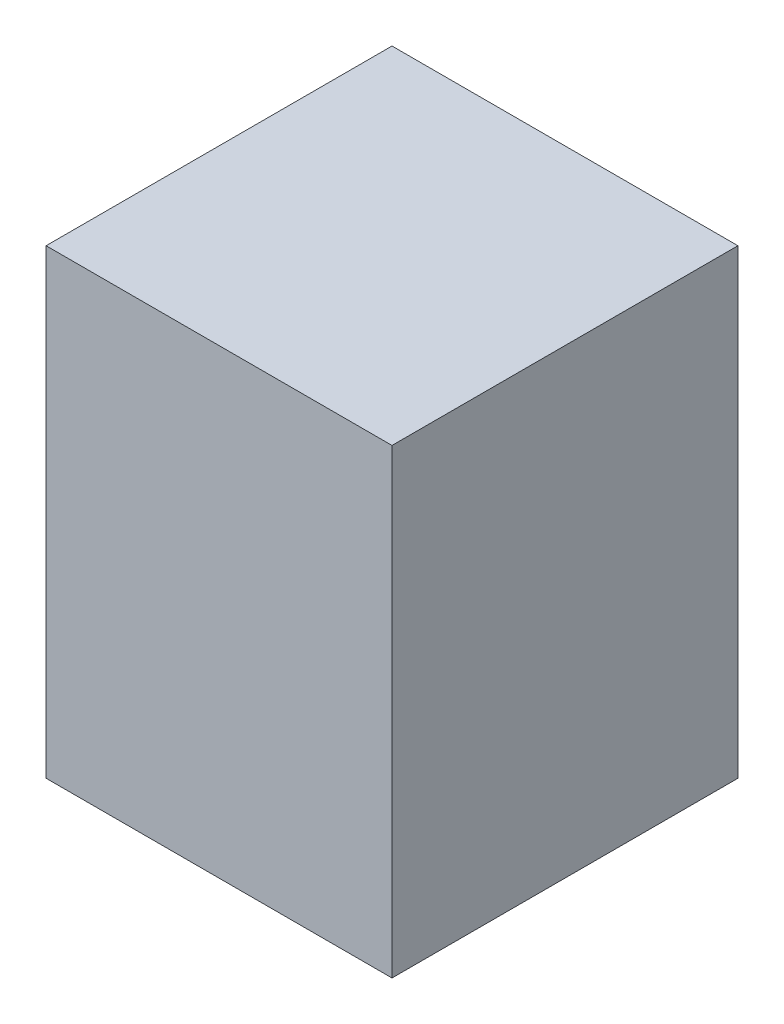
ISO-10303-21;
HEADER;
FILE_DESCRIPTION(('STEP AP214'),'2;1');
FILE_NAME('part.step','',(''),(''),'','','');
FILE_SCHEMA(('AUTOMOTIVE_DESIGN { 1 0 10303 214 1 1 1 1 }'));
ENDSEC;
DATA;
#1=APPLICATION_CONTEXT('core data for automotive mechanical design processes');
#2=APPLICATION_PROTOCOL_DEFINITION('international standard','automotive_design',2000,#1);
#3=PRODUCT_CONTEXT('',#1,'mechanical');
#4=PRODUCT('Part','Part','',(#3));
#5=PRODUCT_RELATED_PRODUCT_CATEGORY('part','',(#4));
#6=PRODUCT_DEFINITION_FORMATION('','',#4);
#7=PRODUCT_DEFINITION_CONTEXT('part definition',#1,'design');
#8=PRODUCT_DEFINITION('design','',#6,#7);
#9=PRODUCT_DEFINITION_SHAPE('','',#8);
#10=(LENGTH_UNIT() NAMED_UNIT(*) SI_UNIT(.MILLI.,.METRE.));
#11=(NAMED_UNIT(*) PLANE_ANGLE_UNIT() SI_UNIT($,.RADIAN.));
#12=(NAMED_UNIT(*) SI_UNIT($,.STERADIAN.) SOLID_ANGLE_UNIT());
#13=UNCERTAINTY_MEASURE_WITH_UNIT(LENGTH_MEASURE(1.E-05),#10,'distance_accuracy_value','');
#14=(GEOMETRIC_REPRESENTATION_CONTEXT(3) GLOBAL_UNCERTAINTY_ASSIGNED_CONTEXT((#13)) GLOBAL_UNIT_ASSIGNED_CONTEXT((#10,
#11,#12)) REPRESENTATION_CONTEXT('',''));
#15=CARTESIAN_POINT('',(0.,0.,0.));
#16=DIRECTION('',(0.,0.,1.));
#17=DIRECTION('',(1.,0.,0.));
#18=AXIS2_PLACEMENT_3D('',#15,#16,#17);
#19=CARTESIAN_POINT('',(0.,406.4,0.));
#20=DIRECTION('',(1.,0.,0.));
#21=DIRECTION('',(0.,0.,-1.));
#22=AXIS2_PLACEMENT_3D('',#19,#20,#21);
#23=PLANE('',#22);
#24=DIRECTION('',(0.,0.,1.));
#25=VECTOR('',#24,1.);
#26=CARTESIAN_POINT('',(0.,0.,0.));
#27=LINE('',#26,#25);
#28=CARTESIAN_POINT('',(0.,0.,-304.8));
#29=VERTEX_POINT('',#28);
#30=CARTESIAN_POINT('',(0.,0.,0.));
#31=VERTEX_POINT('',#30);
#32=EDGE_CURVE('E98',#29,#31,#27,.T.);
#33=ORIENTED_EDGE('',*,*,#32,.T.);
#34=DIRECTION('',(0.,-1.,0.));
#35=VECTOR('',#34,1.);
#36=CARTESIAN_POINT('',(0.,406.4,0.));
#37=LINE('',#36,#35);
#38=CARTESIAN_POINT('',(0.,406.4,0.));
#39=VERTEX_POINT('',#38);
#40=EDGE_CURVE('E11',#39,#31,#37,.T.);
#41=ORIENTED_EDGE('',*,*,#40,.F.);
#42=DIRECTION('',(0.,0.,1.));
#43=VECTOR('',#42,1.);
#44=CARTESIAN_POINT('',(0.,406.4,0.));
#45=LINE('',#44,#43);
#46=CARTESIAN_POINT('',(0.,406.4,-304.8));
#47=VERTEX_POINT('',#46);
#48=EDGE_CURVE('E86',#47,#39,#45,.T.);
#49=ORIENTED_EDGE('',*,*,#48,.F.);
#50=DIRECTION('',(0.,-1.,0.));
#51=VECTOR('',#50,1.);
#52=CARTESIAN_POINT('',(0.,406.4,-304.8));
#53=LINE('',#52,#51);
#54=EDGE_CURVE('E94',#47,#29,#53,.T.);
#55=ORIENTED_EDGE('',*,*,#54,.T.);
#56=EDGE_LOOP('',(#33,#41,#49,#55));
#57=FACE_BOUND('',#56,.T.);
#58=ADVANCED_FACE('F35',(#57),#23,.F.);
#59=CARTESIAN_POINT('',(0.,406.4,0.));
#60=DIRECTION('',(0.,0.,-1.));
#61=DIRECTION('',(-1.,0.,0.));
#62=AXIS2_PLACEMENT_3D('',#59,#60,#61);
#63=PLANE('',#62);
#64=DIRECTION('',(1.,0.,0.));
#65=VECTOR('',#64,1.);
#66=CARTESIAN_POINT('',(0.,0.,0.));
#67=LINE('',#66,#65);
#68=CARTESIAN_POINT('',(304.8,0.,0.));
#69=VERTEX_POINT('',#68);
#70=EDGE_CURVE('E90',#31,#69,#67,.T.);
#71=ORIENTED_EDGE('',*,*,#70,.T.);
#72=DIRECTION('',(0.,-1.,0.));
#73=VECTOR('',#72,1.);
#74=CARTESIAN_POINT('',(304.8,406.4,0.));
#75=LINE('',#74,#73);
#76=CARTESIAN_POINT('',(304.8,406.4,0.));
#77=VERTEX_POINT('',#76);
#78=EDGE_CURVE('E43',#77,#69,#75,.T.);
#79=ORIENTED_EDGE('',*,*,#78,.F.);
#80=DIRECTION('',(1.,0.,0.));
#81=VECTOR('',#80,1.);
#82=CARTESIAN_POINT('',(0.,406.4,0.));
#83=LINE('',#82,#81);
#84=EDGE_CURVE('E81',#39,#77,#83,.T.);
#85=ORIENTED_EDGE('',*,*,#84,.F.);
#86=ORIENTED_EDGE('',*,*,#40,.T.);
#87=EDGE_LOOP('',(#71,#79,#85,#86));
#88=FACE_BOUND('',#87,.T.);
#89=ADVANCED_FACE('F89',(#88),#63,.F.);
#90=CARTESIAN_POINT('',(304.8,406.4,0.));
#91=DIRECTION('',(-1.,0.,0.));
#92=DIRECTION('',(0.,0.,1.));
#93=AXIS2_PLACEMENT_3D('',#90,#91,#92);
#94=PLANE('',#93);
#95=DIRECTION('',(0.,0.,-1.));
#96=VECTOR('',#95,1.);
#97=CARTESIAN_POINT('',(304.8,0.,0.));
#98=LINE('',#97,#96);
#99=CARTESIAN_POINT('',(304.8,0.,-304.8));
#100=VERTEX_POINT('',#99);
#101=EDGE_CURVE('E68',#69,#100,#98,.T.);
#102=ORIENTED_EDGE('',*,*,#101,.T.);
#103=DIRECTION('',(0.,-1.,0.));
#104=VECTOR('',#103,1.);
#105=CARTESIAN_POINT('',(304.8,406.4,-304.8));
#106=LINE('',#105,#104);
#107=CARTESIAN_POINT('',(304.8,406.4,-304.8));
#108=VERTEX_POINT('',#107);
#109=EDGE_CURVE('E91',#108,#100,#106,.T.);
#110=ORIENTED_EDGE('',*,*,#109,.F.);
#111=DIRECTION('',(0.,0.,-1.));
#112=VECTOR('',#111,1.);
#113=CARTESIAN_POINT('',(304.8,406.4,0.));
#114=LINE('',#113,#112);
#115=EDGE_CURVE('E84',#77,#108,#114,.T.);
#116=ORIENTED_EDGE('',*,*,#115,.F.);
#117=ORIENTED_EDGE('',*,*,#78,.T.);
#118=EDGE_LOOP('',(#102,#110,#116,#117));
#119=FACE_BOUND('',#118,.T.);
#120=ADVANCED_FACE('F92',(#119),#94,.F.);
#121=CARTESIAN_POINT('',(0.,406.4,-304.8));
#122=DIRECTION('',(0.,0.,1.));
#123=DIRECTION('',(1.,0.,0.));
#124=AXIS2_PLACEMENT_3D('',#121,#122,#123);
#125=PLANE('',#124);
#126=DIRECTION('',(-1.,0.,0.));
#127=VECTOR('',#126,1.);
#128=CARTESIAN_POINT('',(0.,0.,-304.8));
#129=LINE('',#128,#127);
#130=EDGE_CURVE('E74',#100,#29,#129,.T.);
#131=ORIENTED_EDGE('',*,*,#130,.T.);
#132=ORIENTED_EDGE('',*,*,#54,.F.);
#133=DIRECTION('',(-1.,0.,0.));
#134=VECTOR('',#133,1.);
#135=CARTESIAN_POINT('',(0.,406.4,-304.8));
#136=LINE('',#135,#134);
#137=EDGE_CURVE('E51',#108,#47,#136,.T.);
#138=ORIENTED_EDGE('',*,*,#137,.F.);
#139=ORIENTED_EDGE('',*,*,#109,.T.);
#140=EDGE_LOOP('',(#131,#132,#138,#139));
#141=FACE_BOUND('',#140,.T.);
#142=ADVANCED_FACE('F105',(#141),#125,.F.);
#143=CARTESIAN_POINT('',(0.,406.4,0.));
#144=DIRECTION('',(0.,-1.,0.));
#145=DIRECTION('',(0.,0.,-1.));
#146=AXIS2_PLACEMENT_3D('',#143,#144,#145);
#147=PLANE('',#146);
#148=ORIENTED_EDGE('',*,*,#48,.T.);
#149=ORIENTED_EDGE('',*,*,#84,.T.);
#150=ORIENTED_EDGE('',*,*,#115,.T.);
#151=ORIENTED_EDGE('',*,*,#137,.T.);
#152=EDGE_LOOP('',(#148,#149,#150,#151));
#153=FACE_BOUND('',#152,.T.);
#154=ADVANCED_FACE('F82',(#153),#147,.F.);
#155=CARTESIAN_POINT('',(0.,0.,0.));
#156=DIRECTION('',(0.,-1.,0.));
#157=DIRECTION('',(0.,0.,-1.));
#158=AXIS2_PLACEMENT_3D('',#155,#156,#157);
#159=PLANE('',#158);
#160=ORIENTED_EDGE('',*,*,#32,.F.);
#161=ORIENTED_EDGE('',*,*,#130,.F.);
#162=ORIENTED_EDGE('',*,*,#101,.F.);
#163=ORIENTED_EDGE('',*,*,#70,.F.);
#164=EDGE_LOOP('',(#160,#161,#162,#163));
#165=FACE_BOUND('',#164,.T.);
#166=ADVANCED_FACE('F108',(#165),#159,.T.);
#167=CLOSED_SHELL('',(#58,#89,#120,#142,#154,#166));
#168=MANIFOLD_SOLID_BREP('B2',#167);
#169=ADVANCED_BREP_SHAPE_REPRESENTATION('',(#18,#168),#14);
#170=SHAPE_DEFINITION_REPRESENTATION(#9,#169);
ENDSEC;
END-ISO-10303-21;
